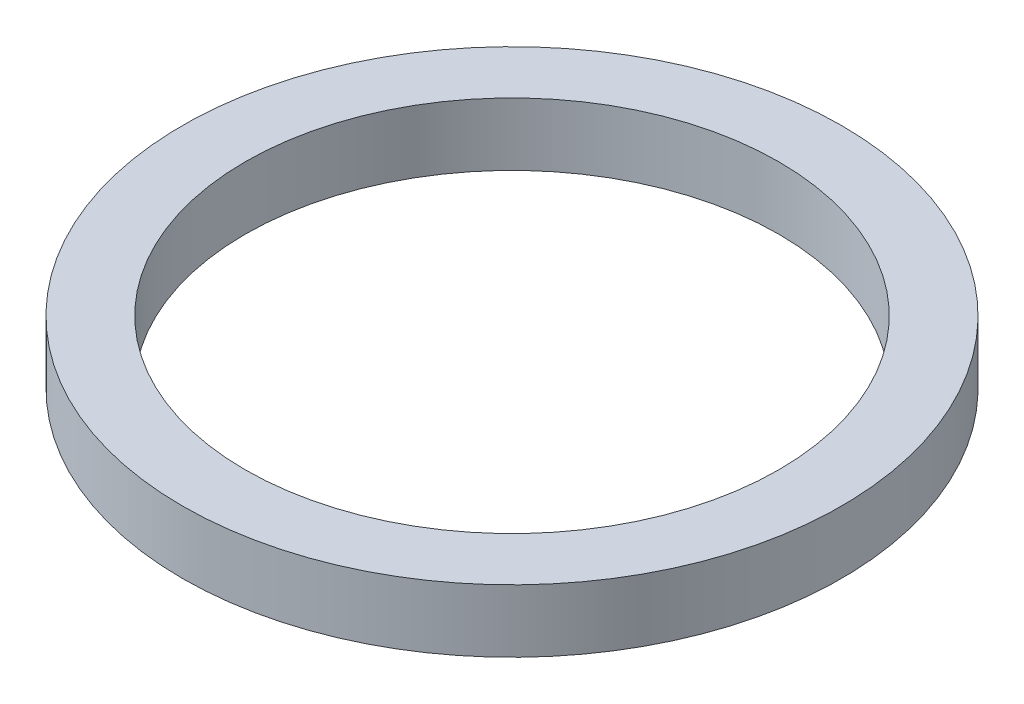
ISO-10303-21;
HEADER;
FILE_DESCRIPTION(('STEP AP214'),'2;1');
FILE_NAME('part.step','',(''),(''),'','','');
FILE_SCHEMA(('AUTOMOTIVE_DESIGN { 1 0 10303 214 1 1 1 1 }'));
ENDSEC;
DATA;
#1=APPLICATION_CONTEXT('core data for automotive mechanical design processes');
#2=APPLICATION_PROTOCOL_DEFINITION('international standard','automotive_design',2000,#1);
#3=PRODUCT_CONTEXT('',#1,'mechanical');
#4=PRODUCT('Part','Part','',(#3));
#5=PRODUCT_RELATED_PRODUCT_CATEGORY('part','',(#4));
#6=PRODUCT_DEFINITION_FORMATION('','',#4);
#7=PRODUCT_DEFINITION_CONTEXT('part definition',#1,'design');
#8=PRODUCT_DEFINITION('design','',#6,#7);
#9=PRODUCT_DEFINITION_SHAPE('','',#8);
#10=(LENGTH_UNIT() NAMED_UNIT(*) SI_UNIT(.MILLI.,.METRE.));
#11=(NAMED_UNIT(*) PLANE_ANGLE_UNIT() SI_UNIT($,.RADIAN.));
#12=(NAMED_UNIT(*) SI_UNIT($,.STERADIAN.) SOLID_ANGLE_UNIT());
#13=UNCERTAINTY_MEASURE_WITH_UNIT(LENGTH_MEASURE(1.E-05),#10,'distance_accuracy_value','');
#14=(GEOMETRIC_REPRESENTATION_CONTEXT(3) GLOBAL_UNCERTAINTY_ASSIGNED_CONTEXT((#13)) GLOBAL_UNIT_ASSIGNED_CONTEXT((#10,
#11,#12)) REPRESENTATION_CONTEXT('',''));
#15=CARTESIAN_POINT('',(0.,0.,0.));
#16=DIRECTION('',(0.,0.,1.));
#17=DIRECTION('',(1.,0.,0.));
#18=AXIS2_PLACEMENT_3D('',#15,#16,#17);
#19=CARTESIAN_POINT('',(0.,10.,0.));
#20=DIRECTION('',(0.,-1.,0.));
#21=DIRECTION('',(0.,0.,-1.));
#22=AXIS2_PLACEMENT_3D('',#19,#20,#21);
#23=CYLINDRICAL_SURFACE('',#22,52.5);
#24=CARTESIAN_POINT('',(0.,10.,0.));
#25=DIRECTION('',(0.,1.,0.));
#26=DIRECTION('',(0.,0.,1.));
#27=AXIS2_PLACEMENT_3D('',#24,#25,#26);
#28=CIRCLE('',#27,52.5);
#29=CARTESIAN_POINT('',(0.,10.,52.5));
#30=VERTEX_POINT('',#29);
#31=EDGE_CURVE('E10',#30,#30,#28,.T.);
#32=ORIENTED_EDGE('',*,*,#31,.F.);
#33=EDGE_LOOP('',(#32));
#34=FACE_BOUND('',#33,.T.);
#35=CARTESIAN_POINT('',(0.,0.,0.));
#36=DIRECTION('',(0.,1.,0.));
#37=DIRECTION('',(0.,0.,1.));
#38=AXIS2_PLACEMENT_3D('',#35,#36,#37);
#39=CIRCLE('',#38,52.5);
#40=CARTESIAN_POINT('',(0.,0.,52.5));
#41=VERTEX_POINT('',#40);
#42=EDGE_CURVE('E37',#41,#41,#39,.T.);
#43=ORIENTED_EDGE('',*,*,#42,.T.);
#44=EDGE_LOOP('',(#43));
#45=FACE_BOUND('',#44,.T.);
#46=ADVANCED_FACE('F40',(#34,#45),#23,.T.);
#47=CARTESIAN_POINT('',(0.,10.,0.));
#48=DIRECTION('',(0.,1.,0.));
#49=DIRECTION('',(0.,0.,1.));
#50=AXIS2_PLACEMENT_3D('',#47,#48,#49);
#51=PLANE('',#50);
#52=CARTESIAN_POINT('',(0.,10.,0.));
#53=DIRECTION('',(0.,1.,0.));
#54=DIRECTION('',(0.,0.,1.));
#55=AXIS2_PLACEMENT_3D('',#52,#53,#54);
#56=CIRCLE('',#55,42.5);
#57=CARTESIAN_POINT('',(0.,10.,42.5));
#58=VERTEX_POINT('',#57);
#59=EDGE_CURVE('E50',#58,#58,#56,.T.);
#60=ORIENTED_EDGE('',*,*,#59,.F.);
#61=EDGE_LOOP('',(#60));
#62=FACE_BOUND('',#61,.T.);
#63=ORIENTED_EDGE('',*,*,#31,.T.);
#64=EDGE_LOOP('',(#63));
#65=FACE_BOUND('',#64,.T.);
#66=ADVANCED_FACE('F59',(#62,#65),#51,.T.);
#67=CARTESIAN_POINT('',(0.,0.,0.));
#68=DIRECTION('',(0.,1.,0.));
#69=DIRECTION('',(0.,0.,1.));
#70=AXIS2_PLACEMENT_3D('',#67,#68,#69);
#71=PLANE('',#70);
#72=CARTESIAN_POINT('',(0.,0.,0.));
#73=DIRECTION('',(0.,1.,0.));
#74=DIRECTION('',(0.,0.,1.));
#75=AXIS2_PLACEMENT_3D('',#72,#73,#74);
#76=CIRCLE('',#75,42.5);
#77=CARTESIAN_POINT('',(0.,0.,42.5));
#78=VERTEX_POINT('',#77);
#79=EDGE_CURVE('E47',#78,#78,#76,.T.);
#80=ORIENTED_EDGE('',*,*,#79,.T.);
#81=EDGE_LOOP('',(#80));
#82=FACE_BOUND('',#81,.T.);
#83=ORIENTED_EDGE('',*,*,#42,.F.);
#84=EDGE_LOOP('',(#83));
#85=FACE_BOUND('',#84,.T.);
#86=ADVANCED_FACE('F58',(#82,#85),#71,.F.);
#87=CARTESIAN_POINT('',(0.,10.,0.));
#88=DIRECTION('',(0.,-1.,0.));
#89=DIRECTION('',(0.,0.,-1.));
#90=AXIS2_PLACEMENT_3D('',#87,#88,#89);
#91=CYLINDRICAL_SURFACE('',#90,42.5);
#92=ORIENTED_EDGE('',*,*,#59,.T.);
#93=EDGE_LOOP('',(#92));
#94=FACE_BOUND('',#93,.T.);
#95=ORIENTED_EDGE('',*,*,#79,.F.);
#96=EDGE_LOOP('',(#95));
#97=FACE_BOUND('',#96,.T.);
#98=ADVANCED_FACE('F54',(#94,#97),#91,.F.);
#99=CLOSED_SHELL('',(#46,#66,#86,#98));
#100=MANIFOLD_SOLID_BREP('B2',#99);
#101=ADVANCED_BREP_SHAPE_REPRESENTATION('',(#18,#100),#14);
#102=SHAPE_DEFINITION_REPRESENTATION(#9,#101);
ENDSEC;
END-ISO-10303-21;
